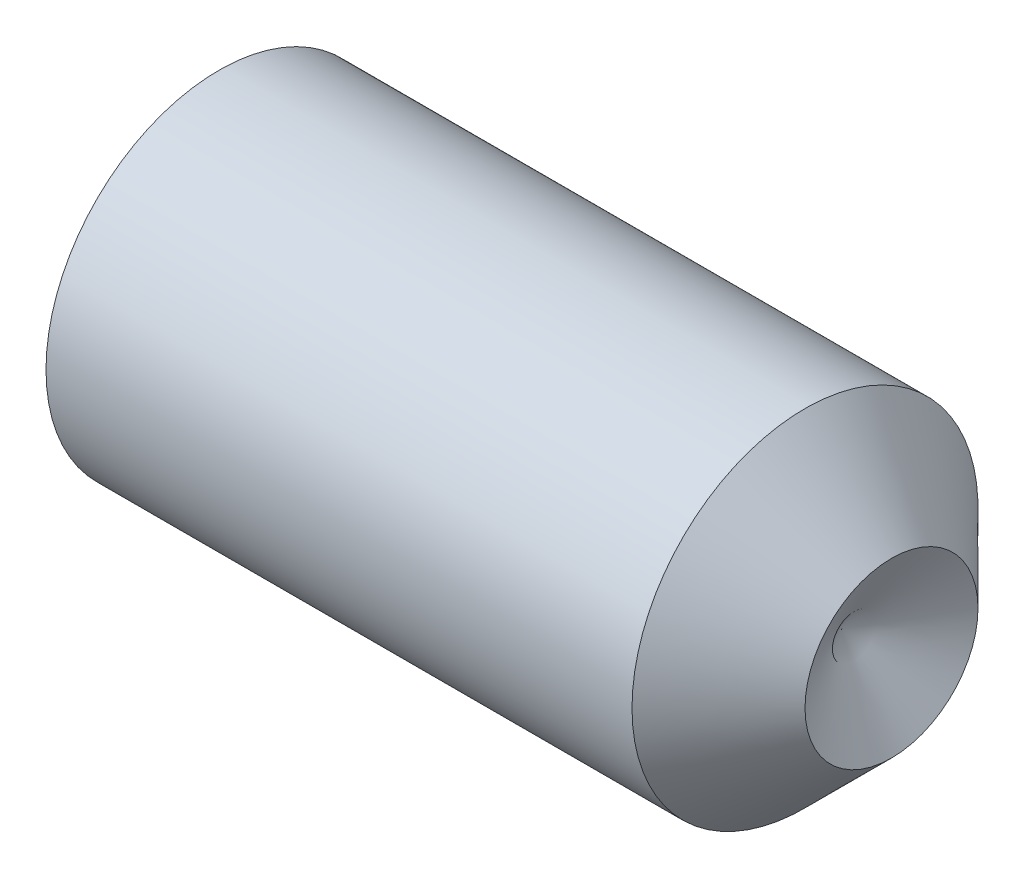
ISO-10303-21;
HEADER;
FILE_DESCRIPTION(('STEP AP214'),'2;1');
FILE_NAME('part.step','',(''),(''),'','','');
FILE_SCHEMA(('AUTOMOTIVE_DESIGN { 1 0 10303 214 1 1 1 1 }'));
ENDSEC;
DATA;
#1=APPLICATION_CONTEXT('core data for automotive mechanical design processes');
#2=APPLICATION_PROTOCOL_DEFINITION('international standard','automotive_design',2000,#1);
#3=PRODUCT_CONTEXT('',#1,'mechanical');
#4=PRODUCT('Part','Part','',(#3));
#5=PRODUCT_RELATED_PRODUCT_CATEGORY('part','',(#4));
#6=PRODUCT_DEFINITION_FORMATION('','',#4);
#7=PRODUCT_DEFINITION_CONTEXT('part definition',#1,'design');
#8=PRODUCT_DEFINITION('design','',#6,#7);
#9=PRODUCT_DEFINITION_SHAPE('','',#8);
#10=(LENGTH_UNIT() NAMED_UNIT(*) SI_UNIT(.MILLI.,.METRE.));
#11=(NAMED_UNIT(*) PLANE_ANGLE_UNIT() SI_UNIT($,.RADIAN.));
#12=(NAMED_UNIT(*) SI_UNIT($,.STERADIAN.) SOLID_ANGLE_UNIT());
#13=UNCERTAINTY_MEASURE_WITH_UNIT(LENGTH_MEASURE(1.E-05),#10,'distance_accuracy_value','');
#14=(GEOMETRIC_REPRESENTATION_CONTEXT(3) GLOBAL_UNCERTAINTY_ASSIGNED_CONTEXT((#13)) GLOBAL_UNIT_ASSIGNED_CONTEXT((#10,
#11,#12)) REPRESENTATION_CONTEXT('',''));
#15=CARTESIAN_POINT('',(0.,0.,0.));
#16=DIRECTION('',(0.,0.,1.));
#17=DIRECTION('',(1.,0.,0.));
#18=AXIS2_PLACEMENT_3D('',#15,#16,#17);
#19=CARTESIAN_POINT('',(0.,0.,0.));
#20=DIRECTION('',(-1.,0.,0.));
#21=DIRECTION('',(0.,0.,1.));
#22=AXIS2_PLACEMENT_3D('',#19,#20,#21);
#23=PLANE('',#22);
#24=CARTESIAN_POINT('',(0.,0.,0.));
#25=DIRECTION('',(-1.,0.,0.));
#26=DIRECTION('',(0.,0.,1.));
#27=AXIS2_PLACEMENT_3D('',#24,#25,#26);
#28=CIRCLE('',#27,1.61);
#29=CARTESIAN_POINT('',(0.,0.,1.61));
#30=VERTEX_POINT('',#29);
#31=EDGE_CURVE('E11',#30,#30,#28,.T.);
#32=ORIENTED_EDGE('',*,*,#31,.T.);
#33=EDGE_LOOP('',(#32));
#34=FACE_BOUND('',#33,.T.);
#35=DIRECTION('',(0.,0.,-1.));
#36=VECTOR('',#35,1.);
#37=CARTESIAN_POINT('',(0.,1.,0.577350269189622));
#38=LINE('',#37,#36);
#39=CARTESIAN_POINT('',(0.,1.,0.577350269189622));
#40=VERTEX_POINT('',#39);
#41=CARTESIAN_POINT('',(0.,1.,-0.577350269189629));
#42=VERTEX_POINT('',#41);
#43=EDGE_CURVE('E98',#40,#42,#38,.T.);
#44=ORIENTED_EDGE('',*,*,#43,.F.);
#45=DIRECTION('',(0.,-0.866025403784438,0.5));
#46=VECTOR('',#45,1.);
#47=CARTESIAN_POINT('',(0.,1.,0.577350269189622));
#48=LINE('',#47,#46);
#49=CARTESIAN_POINT('',(0.,0.,1.15470053837925));
#50=VERTEX_POINT('',#49);
#51=EDGE_CURVE('E51',#40,#50,#48,.T.);
#52=ORIENTED_EDGE('',*,*,#51,.T.);
#53=DIRECTION('',(0.,0.866025403784439,0.5));
#54=VECTOR('',#53,1.);
#55=CARTESIAN_POINT('',(0.,-0.999999999999995,0.577350269189623));
#56=LINE('',#55,#54);
#57=CARTESIAN_POINT('',(0.,-0.999999999999995,0.577350269189623));
#58=VERTEX_POINT('',#57);
#59=EDGE_CURVE('E104',#58,#50,#56,.T.);
#60=ORIENTED_EDGE('',*,*,#59,.F.);
#61=DIRECTION('',(0.,0.,-1.));
#62=VECTOR('',#61,1.);
#63=CARTESIAN_POINT('',(0.,-0.999999999999995,0.577350269189623));
#64=LINE('',#63,#62);
#65=CARTESIAN_POINT('',(0.,-0.999999999999995,-0.577350269189628));
#66=VERTEX_POINT('',#65);
#67=EDGE_CURVE('E124',#58,#66,#64,.T.);
#68=ORIENTED_EDGE('',*,*,#67,.T.);
#69=DIRECTION('',(0.,0.866025403784438,-0.500000000000001));
#70=VECTOR('',#69,1.);
#71=CARTESIAN_POINT('',(0.,-0.999999999999995,-0.577350269189628));
#72=LINE('',#71,#70);
#73=CARTESIAN_POINT('',(0.,0.,-1.15470053837925));
#74=VERTEX_POINT('',#73);
#75=EDGE_CURVE('E127',#66,#74,#72,.T.);
#76=ORIENTED_EDGE('',*,*,#75,.T.);
#77=DIRECTION('',(0.,-0.866025403784439,-0.5));
#78=VECTOR('',#77,1.);
#79=CARTESIAN_POINT('',(0.,1.,-0.577350269189629));
#80=LINE('',#79,#78);
#81=EDGE_CURVE('E130',#42,#74,#80,.T.);
#82=ORIENTED_EDGE('',*,*,#81,.F.);
#83=EDGE_LOOP('',(#44,#52,#60,#68,#76,#82));
#84=FACE_BOUND('',#83,.T.);
#85=ADVANCED_FACE('F37',(#34,#84),#23,.T.);
#86=CARTESIAN_POINT('',(0.,0.,0.));
#87=DIRECTION('',(1.,0.,0.));
#88=DIRECTION('',(0.,0.,-1.));
#89=AXIS2_PLACEMENT_3D('',#86,#87,#88);
#90=CONICAL_SURFACE('',#89,1.61,1.0471975511966);
#91=CARTESIAN_POINT('',(0.225166604983952,0.,0.));
#92=DIRECTION('',(-1.,0.,0.));
#93=DIRECTION('',(0.,0.,1.));
#94=AXIS2_PLACEMENT_3D('',#91,#92,#93);
#95=CIRCLE('',#94,2.);
#96=CARTESIAN_POINT('',(0.225166604983952,0.,2.));
#97=VERTEX_POINT('',#96);
#98=EDGE_CURVE('E44',#97,#97,#95,.T.);
#99=ORIENTED_EDGE('',*,*,#98,.T.);
#100=EDGE_LOOP('',(#99));
#101=FACE_BOUND('',#100,.T.);
#102=ORIENTED_EDGE('',*,*,#31,.F.);
#103=EDGE_LOOP('',(#102));
#104=FACE_BOUND('',#103,.T.);
#105=ADVANCED_FACE('F150',(#101,#104),#90,.T.);
#106=CARTESIAN_POINT('',(-12.7,0.,0.));
#107=DIRECTION('',(-1.,0.,0.));
#108=DIRECTION('',(0.,0.,1.));
#109=AXIS2_PLACEMENT_3D('',#106,#107,#108);
#110=CYLINDRICAL_SURFACE('',#109,2.);
#111=CARTESIAN_POINT('',(7.,0.,0.));
#112=DIRECTION('',(-1.,0.,0.));
#113=DIRECTION('',(0.,0.,1.));
#114=AXIS2_PLACEMENT_3D('',#111,#112,#113);
#115=CIRCLE('',#114,2.);
#116=CARTESIAN_POINT('',(7.,0.,2.));
#117=VERTEX_POINT('',#116);
#118=EDGE_CURVE('E145',#117,#117,#115,.T.);
#119=ORIENTED_EDGE('',*,*,#118,.T.);
#120=EDGE_LOOP('',(#119));
#121=FACE_BOUND('',#120,.T.);
#122=ORIENTED_EDGE('',*,*,#98,.F.);
#123=EDGE_LOOP('',(#122));
#124=FACE_BOUND('',#123,.T.);
#125=ADVANCED_FACE('F153',(#121,#124),#110,.T.);
#126=CARTESIAN_POINT('',(7.,0.,0.));
#127=DIRECTION('',(-1.,0.,0.));
#128=DIRECTION('',(0.,0.,1.));
#129=AXIS2_PLACEMENT_3D('',#126,#127,#128);
#130=CONICAL_SURFACE('',#129,2.,0.785398163397448);
#131=CARTESIAN_POINT('',(8.,0.,0.));
#132=DIRECTION('',(-1.,0.,0.));
#133=DIRECTION('',(0.,0.,1.));
#134=AXIS2_PLACEMENT_3D('',#131,#132,#133);
#135=CIRCLE('',#134,1.);
#136=CARTESIAN_POINT('',(8.,0.,1.));
#137=VERTEX_POINT('',#136);
#138=EDGE_CURVE('E105',#137,#137,#135,.T.);
#139=ORIENTED_EDGE('',*,*,#138,.T.);
#140=EDGE_LOOP('',(#139));
#141=FACE_BOUND('',#140,.T.);
#142=ORIENTED_EDGE('',*,*,#118,.F.);
#143=EDGE_LOOP('',(#142));
#144=FACE_BOUND('',#143,.T.);
#145=ADVANCED_FACE('F155',(#141,#144),#130,.T.);
#146=CARTESIAN_POINT('',(7.42264973081038,0.,0.));
#147=DIRECTION('',(1.,0.,0.));
#148=DIRECTION('',(0.,0.,-1.));
#149=AXIS2_PLACEMENT_3D('',#146,#147,#148);
#150=CONICAL_SURFACE('',#149,0.,1.0471975511966);
#151=ORIENTED_EDGE('',*,*,#138,.F.);
#152=EDGE_LOOP('',(#151));
#153=FACE_BOUND('',#152,.T.);
#154=CARTESIAN_POINT('',(7.42264973081038,0.,0.));
#155=VERTEX_POINT('',#154);
#156=VERTEX_LOOP('',#155);
#157=FACE_BOUND('',#156,.T.);
#158=ADVANCED_FACE('F162',(#153,#157),#150,.F.);
#159=CARTESIAN_POINT('',(2.5,1.,0.577350269189622));
#160=DIRECTION('',(0.,-0.5,-0.866025403784438));
#161=DIRECTION('',(0.,0.866025403784438,-0.500000000000001));
#162=AXIS2_PLACEMENT_3D('',#159,#160,#161);
#163=PLANE('',#162);
#164=ORIENTED_EDGE('',*,*,#51,.F.);
#165=DIRECTION('',(-1.,0.,0.));
#166=VECTOR('',#165,1.);
#167=CARTESIAN_POINT('',(2.5,1.,0.577350269189622));
#168=LINE('',#167,#166);
#169=CARTESIAN_POINT('',(2.5,1.,0.577350269189622));
#170=VERTEX_POINT('',#169);
#171=EDGE_CURVE('E92',#170,#40,#168,.T.);
#172=ORIENTED_EDGE('',*,*,#171,.F.);
#173=DIRECTION('',(0.,-0.866025403784438,0.5));
#174=VECTOR('',#173,1.);
#175=CARTESIAN_POINT('',(2.5,1.,0.577350269189622));
#176=LINE('',#175,#174);
#177=CARTESIAN_POINT('',(2.5,0.,1.15470053837925));
#178=VERTEX_POINT('',#177);
#179=EDGE_CURVE('E87',#170,#178,#176,.T.);
#180=ORIENTED_EDGE('',*,*,#179,.T.);
#181=DIRECTION('',(-1.,0.,0.));
#182=VECTOR('',#181,1.);
#183=CARTESIAN_POINT('',(2.5,0.,1.15470053837925));
#184=LINE('',#183,#182);
#185=EDGE_CURVE('E90',#178,#50,#184,.T.);
#186=ORIENTED_EDGE('',*,*,#185,.T.);
#187=EDGE_LOOP('',(#164,#172,#180,#186));
#188=FACE_BOUND('',#187,.T.);
#189=ADVANCED_FACE('F89',(#188),#163,.T.);
#190=CARTESIAN_POINT('',(2.5,-0.999999999999995,0.577350269189623));
#191=DIRECTION('',(0.,-0.5,0.866025403784439));
#192=DIRECTION('',(0.,-0.866025403784439,-0.5));
#193=AXIS2_PLACEMENT_3D('',#190,#191,#192);
#194=PLANE('',#193);
#195=ORIENTED_EDGE('',*,*,#59,.T.);
#196=ORIENTED_EDGE('',*,*,#185,.F.);
#197=DIRECTION('',(0.,0.866025403784439,0.5));
#198=VECTOR('',#197,1.);
#199=CARTESIAN_POINT('',(2.5,-0.999999999999995,0.577350269189623));
#200=LINE('',#199,#198);
#201=CARTESIAN_POINT('',(2.5,-0.999999999999995,0.577350269189623));
#202=VERTEX_POINT('',#201);
#203=EDGE_CURVE('E97',#202,#178,#200,.T.);
#204=ORIENTED_EDGE('',*,*,#203,.F.);
#205=DIRECTION('',(-1.,0.,0.));
#206=VECTOR('',#205,1.);
#207=CARTESIAN_POINT('',(2.5,-0.999999999999995,0.577350269189623));
#208=LINE('',#207,#206);
#209=EDGE_CURVE('E106',#202,#58,#208,.T.);
#210=ORIENTED_EDGE('',*,*,#209,.T.);
#211=EDGE_LOOP('',(#195,#196,#204,#210));
#212=FACE_BOUND('',#211,.T.);
#213=ADVANCED_FACE('F102',(#212),#194,.F.);
#214=CARTESIAN_POINT('',(2.5,-0.999999999999995,0.577350269189623));
#215=DIRECTION('',(0.,1.,0.));
#216=DIRECTION('',(0.,0.,1.));
#217=AXIS2_PLACEMENT_3D('',#214,#215,#216);
#218=PLANE('',#217);
#219=ORIENTED_EDGE('',*,*,#67,.F.);
#220=ORIENTED_EDGE('',*,*,#209,.F.);
#221=DIRECTION('',(0.,0.,-1.));
#222=VECTOR('',#221,1.);
#223=CARTESIAN_POINT('',(2.5,-0.999999999999995,0.577350269189623));
#224=LINE('',#223,#222);
#225=CARTESIAN_POINT('',(2.5,-0.999999999999995,-0.577350269189628));
#226=VERTEX_POINT('',#225);
#227=EDGE_CURVE('E111',#202,#226,#224,.T.);
#228=ORIENTED_EDGE('',*,*,#227,.T.);
#229=DIRECTION('',(-1.,0.,0.));
#230=VECTOR('',#229,1.);
#231=CARTESIAN_POINT('',(2.5,-0.999999999999995,-0.577350269189628));
#232=LINE('',#231,#230);
#233=EDGE_CURVE('E140',#226,#66,#232,.T.);
#234=ORIENTED_EDGE('',*,*,#233,.T.);
#235=EDGE_LOOP('',(#219,#220,#228,#234));
#236=FACE_BOUND('',#235,.T.);
#237=ADVANCED_FACE('F185',(#236),#218,.T.);
#238=CARTESIAN_POINT('',(2.5,-0.999999999999995,-0.577350269189628));
#239=DIRECTION('',(0.,0.500000000000001,0.866025403784438));
#240=DIRECTION('',(0.,-0.866025403784438,0.500000000000001));
#241=AXIS2_PLACEMENT_3D('',#238,#239,#240);
#242=PLANE('',#241);
#243=ORIENTED_EDGE('',*,*,#75,.F.);
#244=ORIENTED_EDGE('',*,*,#233,.F.);
#245=DIRECTION('',(0.,0.866025403784438,-0.500000000000001));
#246=VECTOR('',#245,1.);
#247=CARTESIAN_POINT('',(2.5,-0.999999999999995,-0.577350269189628));
#248=LINE('',#247,#246);
#249=CARTESIAN_POINT('',(2.5,0.,-1.15470053837925));
#250=VERTEX_POINT('',#249);
#251=EDGE_CURVE('E113',#226,#250,#248,.T.);
#252=ORIENTED_EDGE('',*,*,#251,.T.);
#253=DIRECTION('',(-1.,0.,0.));
#254=VECTOR('',#253,1.);
#255=CARTESIAN_POINT('',(2.5,0.,-1.15470053837925));
#256=LINE('',#255,#254);
#257=EDGE_CURVE('E138',#250,#74,#256,.T.);
#258=ORIENTED_EDGE('',*,*,#257,.T.);
#259=EDGE_LOOP('',(#243,#244,#252,#258));
#260=FACE_BOUND('',#259,.T.);
#261=ADVANCED_FACE('F181',(#260),#242,.T.);
#262=CARTESIAN_POINT('',(2.5,1.,-0.577350269189629));
#263=DIRECTION('',(0.,0.5,-0.866025403784439));
#264=DIRECTION('',(0.,0.866025403784439,0.5));
#265=AXIS2_PLACEMENT_3D('',#262,#263,#264);
#266=PLANE('',#265);
#267=ORIENTED_EDGE('',*,*,#81,.T.);
#268=ORIENTED_EDGE('',*,*,#257,.F.);
#269=DIRECTION('',(0.,-0.866025403784439,-0.5));
#270=VECTOR('',#269,1.);
#271=CARTESIAN_POINT('',(2.5,1.,-0.577350269189629));
#272=LINE('',#271,#270);
#273=CARTESIAN_POINT('',(2.5,1.,-0.577350269189629));
#274=VERTEX_POINT('',#273);
#275=EDGE_CURVE('E117',#274,#250,#272,.T.);
#276=ORIENTED_EDGE('',*,*,#275,.F.);
#277=DIRECTION('',(-1.,0.,0.));
#278=VECTOR('',#277,1.);
#279=CARTESIAN_POINT('',(2.5,1.,-0.577350269189629));
#280=LINE('',#279,#278);
#281=EDGE_CURVE('E136',#274,#42,#280,.T.);
#282=ORIENTED_EDGE('',*,*,#281,.T.);
#283=EDGE_LOOP('',(#267,#268,#276,#282));
#284=FACE_BOUND('',#283,.T.);
#285=ADVANCED_FACE('F178',(#284),#266,.F.);
#286=CARTESIAN_POINT('',(2.5,1.,0.577350269189622));
#287=DIRECTION('',(0.,1.,0.));
#288=DIRECTION('',(0.,0.,1.));
#289=AXIS2_PLACEMENT_3D('',#286,#287,#288);
#290=PLANE('',#289);
#291=ORIENTED_EDGE('',*,*,#43,.T.);
#292=ORIENTED_EDGE('',*,*,#281,.F.);
#293=DIRECTION('',(0.,0.,-1.));
#294=VECTOR('',#293,1.);
#295=CARTESIAN_POINT('',(2.5,1.,0.577350269189622));
#296=LINE('',#295,#294);
#297=EDGE_CURVE('E120',#170,#274,#296,.T.);
#298=ORIENTED_EDGE('',*,*,#297,.F.);
#299=ORIENTED_EDGE('',*,*,#171,.T.);
#300=EDGE_LOOP('',(#291,#292,#298,#299));
#301=FACE_BOUND('',#300,.T.);
#302=ADVANCED_FACE('F174',(#301),#290,.F.);
#303=CARTESIAN_POINT('',(2.5,2.,0.));
#304=DIRECTION('',(1.,0.,0.));
#305=DIRECTION('',(0.,0.,-1.));
#306=AXIS2_PLACEMENT_3D('',#303,#304,#305);
#307=PLANE('',#306);
#308=ORIENTED_EDGE('',*,*,#179,.F.);
#309=ORIENTED_EDGE('',*,*,#297,.T.);
#310=ORIENTED_EDGE('',*,*,#275,.T.);
#311=ORIENTED_EDGE('',*,*,#251,.F.);
#312=ORIENTED_EDGE('',*,*,#227,.F.);
#313=ORIENTED_EDGE('',*,*,#203,.T.);
#314=EDGE_LOOP('',(#308,#309,#310,#311,#312,#313));
#315=FACE_BOUND('',#314,.T.);
#316=ADVANCED_FACE('F109',(#315),#307,.F.);
#317=CLOSED_SHELL('',(#85,#105,#125,#145,#158,#189,#213,#237,#261,#285,#302,#316));
#318=MANIFOLD_SOLID_BREP('B2',#317);
#319=ADVANCED_BREP_SHAPE_REPRESENTATION('',(#18,#318),#14);
#320=SHAPE_DEFINITION_REPRESENTATION(#9,#319);
ENDSEC;
END-ISO-10303-21;
